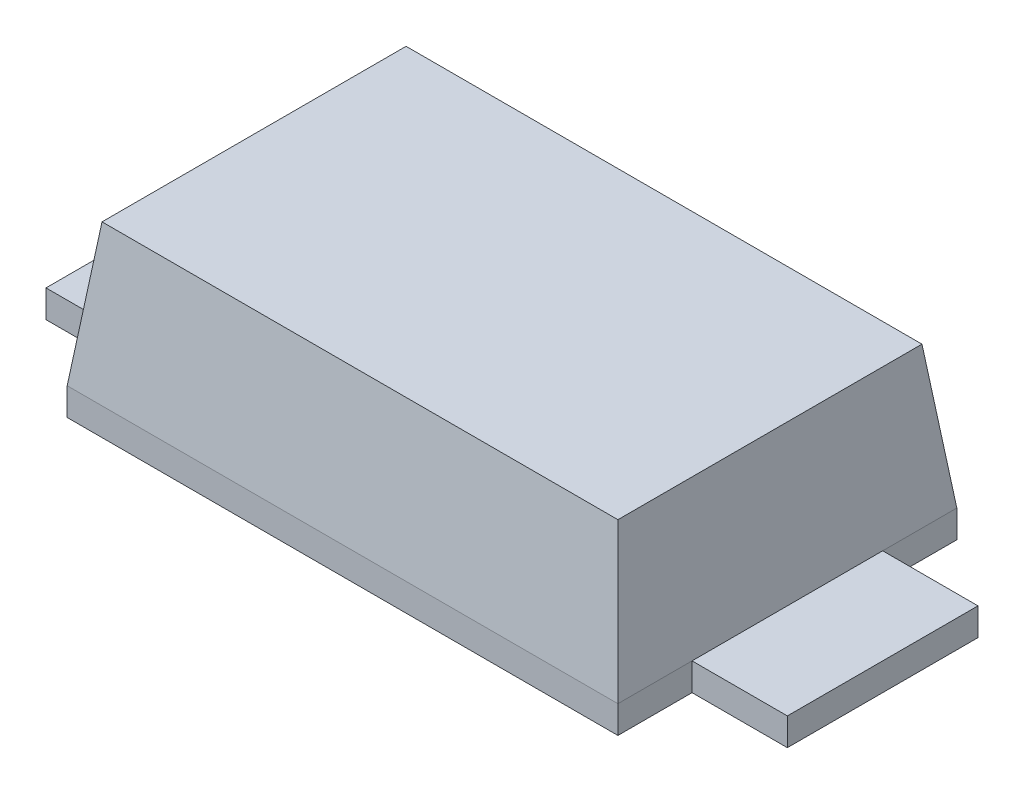
ISO-10303-21;
HEADER;
FILE_DESCRIPTION(('STEP AP214'),'2;1');
FILE_NAME('part.step','',(''),(''),'','','');
FILE_SCHEMA(('AUTOMOTIVE_DESIGN { 1 0 10303 214 1 1 1 1 }'));
ENDSEC;
DATA;
#1=APPLICATION_CONTEXT('core data for automotive mechanical design processes');
#2=APPLICATION_PROTOCOL_DEFINITION('international standard','automotive_design',2000,#1);
#3=PRODUCT_CONTEXT('',#1,'mechanical');
#4=PRODUCT('Part','Part','',(#3));
#5=PRODUCT_RELATED_PRODUCT_CATEGORY('part','',(#4));
#6=PRODUCT_DEFINITION_FORMATION('','',#4);
#7=PRODUCT_DEFINITION_CONTEXT('part definition',#1,'design');
#8=PRODUCT_DEFINITION('design','',#6,#7);
#9=PRODUCT_DEFINITION_SHAPE('','',#8);
#10=(LENGTH_UNIT() NAMED_UNIT(*) SI_UNIT(.MILLI.,.METRE.));
#11=(NAMED_UNIT(*) PLANE_ANGLE_UNIT() SI_UNIT($,.RADIAN.));
#12=(NAMED_UNIT(*) SI_UNIT($,.STERADIAN.) SOLID_ANGLE_UNIT());
#13=UNCERTAINTY_MEASURE_WITH_UNIT(LENGTH_MEASURE(1.E-05),#10,'distance_accuracy_value','');
#14=(GEOMETRIC_REPRESENTATION_CONTEXT(3) GLOBAL_UNCERTAINTY_ASSIGNED_CONTEXT((#13)) GLOBAL_UNIT_ASSIGNED_CONTEXT((#10,
#11,#12)) REPRESENTATION_CONTEXT('',''));
#15=CARTESIAN_POINT('',(0.,0.,0.));
#16=DIRECTION('',(0.,0.,1.));
#17=DIRECTION('',(1.,0.,0.));
#18=AXIS2_PLACEMENT_3D('',#15,#16,#17);
#19=CARTESIAN_POINT('',(-1.3156,0.8,0.717734344));
#20=DIRECTION('',(0.,-0.121869343689811,-0.99254615160637));
#21=DIRECTION('',(1.,0.,0.));
#22=AXIS2_PLACEMENT_3D('',#19,#20,#21);
#23=PLANE('',#22);
#24=DIRECTION('',(1.,0.,0.));
#25=VECTOR('',#24,1.);
#26=CARTESIAN_POINT('',(0.,0.13,0.8));
#27=LINE('',#26,#25);
#28=CARTESIAN_POINT('',(-1.3,0.130000000000001,0.8));
#29=VERTEX_POINT('',#28);
#30=CARTESIAN_POINT('',(1.3,0.13,0.8));
#31=VERTEX_POINT('',#30);
#32=EDGE_CURVE('E164',#29,#31,#27,.T.);
#33=ORIENTED_EDGE('',*,*,#32,.T.);
#34=DIRECTION('',(-0.120974291429793,0.985256535946917,-0.120974291429792));
#35=VECTOR('',#34,1.);
#36=CARTESIAN_POINT('',(1.3,0.13,0.8));
#37=LINE('',#36,#35);
#38=CARTESIAN_POINT('',(1.217734344,0.8,0.717734344));
#39=VERTEX_POINT('',#38);
#40=EDGE_CURVE('E168',#31,#39,#37,.T.);
#41=ORIENTED_EDGE('',*,*,#40,.T.);
#42=DIRECTION('',(-1.,0.,0.));
#43=VECTOR('',#42,1.);
#44=CARTESIAN_POINT('',(0.,0.8,0.717734344));
#45=LINE('',#44,#43);
#46=CARTESIAN_POINT('',(-1.217734344,0.8,0.717734344));
#47=VERTEX_POINT('',#46);
#48=EDGE_CURVE('E167',#39,#47,#45,.T.);
#49=ORIENTED_EDGE('',*,*,#48,.T.);
#50=DIRECTION('',(-0.120974291429793,-0.985256535946917,0.120974291429792));
#51=VECTOR('',#50,1.);
#52=CARTESIAN_POINT('',(-1.217734344,0.8,0.717734344));
#53=LINE('',#52,#51);
#54=EDGE_CURVE('E127',#47,#29,#53,.T.);
#55=ORIENTED_EDGE('',*,*,#54,.T.);
#56=EDGE_LOOP('',(#33,#41,#49,#55));
#57=FACE_BOUND('',#56,.T.);
#58=ADVANCED_FACE('F16',(#57),#23,.F.);
#59=CARTESIAN_POINT('',(-1.217734344,0.8,-0.8));
#60=DIRECTION('',(0.99254615160637,-0.121869343689812,0.));
#61=DIRECTION('',(0.,0.,1.));
#62=AXIS2_PLACEMENT_3D('',#59,#60,#61);
#63=PLANE('',#62);
#64=DIRECTION('',(0.,0.,1.));
#65=VECTOR('',#64,1.);
#66=CARTESIAN_POINT('',(-1.3,0.13,0.625));
#67=LINE('',#66,#65);
#68=CARTESIAN_POINT('',(-1.3,0.13,0.45));
#69=VERTEX_POINT('',#68);
#70=EDGE_CURVE('E172',#69,#29,#67,.T.);
#71=ORIENTED_EDGE('',*,*,#70,.T.);
#72=ORIENTED_EDGE('',*,*,#54,.F.);
#73=DIRECTION('',(0.,0.,-1.));
#74=VECTOR('',#73,1.);
#75=CARTESIAN_POINT('',(-1.217734344,0.8,0.));
#76=LINE('',#75,#74);
#77=CARTESIAN_POINT('',(-1.217734344,0.8,-0.717734344));
#78=VERTEX_POINT('',#77);
#79=EDGE_CURVE('E123',#47,#78,#76,.T.);
#80=ORIENTED_EDGE('',*,*,#79,.T.);
#81=DIRECTION('',(0.120974291429793,0.985256535946917,0.120974291429792));
#82=VECTOR('',#81,1.);
#83=CARTESIAN_POINT('',(-1.3,0.13,-0.8));
#84=LINE('',#83,#82);
#85=CARTESIAN_POINT('',(-1.3,0.13,-0.8));
#86=VERTEX_POINT('',#85);
#87=EDGE_CURVE('E20',#86,#78,#84,.T.);
#88=ORIENTED_EDGE('',*,*,#87,.F.);
#89=DIRECTION('',(0.,0.,-1.));
#90=VECTOR('',#89,1.);
#91=CARTESIAN_POINT('',(-1.3,0.13,0.));
#92=LINE('',#91,#90);
#93=CARTESIAN_POINT('',(-1.3,0.13,-0.45));
#94=VERTEX_POINT('',#93);
#95=EDGE_CURVE('E120',#94,#86,#92,.T.);
#96=ORIENTED_EDGE('',*,*,#95,.F.);
#97=DIRECTION('',(0.,0.,-1.));
#98=VECTOR('',#97,1.);
#99=CARTESIAN_POINT('',(-1.3,0.13,0.));
#100=LINE('',#99,#98);
#101=EDGE_CURVE('E169',#69,#94,#100,.T.);
#102=ORIENTED_EDGE('',*,*,#101,.F.);
#103=EDGE_LOOP('',(#71,#72,#80,#88,#96,#102));
#104=FACE_BOUND('',#103,.T.);
#105=ADVANCED_FACE('F117',(#104),#63,.F.);
#106=CARTESIAN_POINT('',(-1.75,0.13,-0.45));
#107=DIRECTION('',(0.,1.,0.));
#108=DIRECTION('',(0.,0.,1.));
#109=AXIS2_PLACEMENT_3D('',#106,#107,#108);
#110=PLANE('',#109);
#111=DIRECTION('',(0.,0.,-1.));
#112=VECTOR('',#111,1.);
#113=CARTESIAN_POINT('',(-1.75,0.13,0.));
#114=LINE('',#113,#112);
#115=CARTESIAN_POINT('',(-1.75,0.13,0.45));
#116=VERTEX_POINT('',#115);
#117=CARTESIAN_POINT('',(-1.75,0.13,-0.45));
#118=VERTEX_POINT('',#117);
#119=EDGE_CURVE('E159',#116,#118,#114,.T.);
#120=ORIENTED_EDGE('',*,*,#119,.F.);
#121=DIRECTION('',(-1.,0.,0.));
#122=VECTOR('',#121,1.);
#123=CARTESIAN_POINT('',(-1.525,0.13,0.45));
#124=LINE('',#123,#122);
#125=EDGE_CURVE('E206',#69,#116,#124,.T.);
#126=ORIENTED_EDGE('',*,*,#125,.F.);
#127=ORIENTED_EDGE('',*,*,#101,.T.);
#128=DIRECTION('',(1.,0.,0.));
#129=VECTOR('',#128,1.);
#130=CARTESIAN_POINT('',(-1.525,0.13,-0.45));
#131=LINE('',#130,#129);
#132=EDGE_CURVE('E217',#118,#94,#131,.T.);
#133=ORIENTED_EDGE('',*,*,#132,.F.);
#134=EDGE_LOOP('',(#120,#126,#127,#133));
#135=FACE_BOUND('',#134,.T.);
#136=ADVANCED_FACE('F216',(#135),#110,.T.);
#137=CARTESIAN_POINT('',(1.217734344,0.8,0.8));
#138=DIRECTION('',(-0.99254615160637,-0.121869343689812,0.));
#139=DIRECTION('',(0.,0.,-1.));
#140=AXIS2_PLACEMENT_3D('',#137,#138,#139);
#141=PLANE('',#140);
#142=DIRECTION('',(0.,0.,1.));
#143=VECTOR('',#142,1.);
#144=CARTESIAN_POINT('',(1.217734344,0.8,0.));
#145=LINE('',#144,#143);
#146=CARTESIAN_POINT('',(1.217734344,0.8,-0.717734344));
#147=VERTEX_POINT('',#146);
#148=EDGE_CURVE('E163',#147,#39,#145,.T.);
#149=ORIENTED_EDGE('',*,*,#148,.T.);
#150=ORIENTED_EDGE('',*,*,#40,.F.);
#151=DIRECTION('',(0.,0.,-1.));
#152=VECTOR('',#151,1.);
#153=CARTESIAN_POINT('',(1.3,0.13,0.625));
#154=LINE('',#153,#152);
#155=CARTESIAN_POINT('',(1.3,0.13,0.45));
#156=VERTEX_POINT('',#155);
#157=EDGE_CURVE('E155',#31,#156,#154,.T.);
#158=ORIENTED_EDGE('',*,*,#157,.T.);
#159=DIRECTION('',(0.,0.,1.));
#160=VECTOR('',#159,1.);
#161=CARTESIAN_POINT('',(1.3,0.13,0.));
#162=LINE('',#161,#160);
#163=CARTESIAN_POINT('',(1.3,0.13,-0.45));
#164=VERTEX_POINT('',#163);
#165=EDGE_CURVE('E227',#164,#156,#162,.T.);
#166=ORIENTED_EDGE('',*,*,#165,.F.);
#167=DIRECTION('',(0.,0.,1.));
#168=VECTOR('',#167,1.);
#169=CARTESIAN_POINT('',(1.3,0.13,0.));
#170=LINE('',#169,#168);
#171=CARTESIAN_POINT('',(1.3,0.13,-0.8));
#172=VERTEX_POINT('',#171);
#173=EDGE_CURVE('E35',#172,#164,#170,.T.);
#174=ORIENTED_EDGE('',*,*,#173,.F.);
#175=DIRECTION('',(0.120974291429793,-0.985256535946917,-0.120974291429792));
#176=VECTOR('',#175,1.);
#177=CARTESIAN_POINT('',(1.217734344,0.8,-0.717734344));
#178=LINE('',#177,#176);
#179=EDGE_CURVE('E133',#147,#172,#178,.T.);
#180=ORIENTED_EDGE('',*,*,#179,.F.);
#181=EDGE_LOOP('',(#149,#150,#158,#166,#174,#180));
#182=FACE_BOUND('',#181,.T.);
#183=ADVANCED_FACE('F276',(#182),#141,.F.);
#184=CARTESIAN_POINT('',(-1.3,0.,0.8));
#185=DIRECTION('',(1.,0.,0.));
#186=DIRECTION('',(0.,0.,-1.));
#187=AXIS2_PLACEMENT_3D('',#184,#185,#186);
#188=PLANE('',#187);
#189=ORIENTED_EDGE('',*,*,#70,.F.);
#190=DIRECTION('',(0.,1.,0.));
#191=VECTOR('',#190,1.);
#192=CARTESIAN_POINT('',(-1.3,0.065,0.45));
#193=LINE('',#192,#191);
#194=CARTESIAN_POINT('',(-1.299999999625,0.,0.45));
#195=VERTEX_POINT('',#194);
#196=EDGE_CURVE('E183',#195,#69,#193,.T.);
#197=ORIENTED_EDGE('',*,*,#196,.F.);
#198=DIRECTION('',(0.,0.,-1.));
#199=VECTOR('',#198,1.);
#200=CARTESIAN_POINT('',(-1.2999999985,0.,0.));
#201=LINE('',#200,#199);
#202=CARTESIAN_POINT('',(-1.299999999625,0.,0.8));
#203=VERTEX_POINT('',#202);
#204=EDGE_CURVE('E238',#203,#195,#201,.T.);
#205=ORIENTED_EDGE('',*,*,#204,.F.);
#206=DIRECTION('',(0.,1.,0.));
#207=VECTOR('',#206,1.);
#208=CARTESIAN_POINT('',(-1.3,0.065,0.8));
#209=LINE('',#208,#207);
#210=EDGE_CURVE('E190',#203,#29,#209,.T.);
#211=ORIENTED_EDGE('',*,*,#210,.T.);
#212=EDGE_LOOP('',(#189,#197,#205,#211));
#213=FACE_BOUND('',#212,.T.);
#214=ADVANCED_FACE('F274',(#213),#188,.F.);
#215=CARTESIAN_POINT('',(-1.75,0.,0.45));
#216=DIRECTION('',(0.,0.,1.));
#217=DIRECTION('',(1.,0.,0.));
#218=AXIS2_PLACEMENT_3D('',#215,#216,#217);
#219=PLANE('',#218);
#220=DIRECTION('',(0.,1.,0.));
#221=VECTOR('',#220,1.);
#222=CARTESIAN_POINT('',(-1.75,0.065,0.45));
#223=LINE('',#222,#221);
#224=CARTESIAN_POINT('',(-1.75,0.,0.45));
#225=VERTEX_POINT('',#224);
#226=EDGE_CURVE('E204',#225,#116,#223,.T.);
#227=ORIENTED_EDGE('',*,*,#226,.F.);
#228=DIRECTION('',(-1.,0.,0.));
#229=VECTOR('',#228,1.);
#230=CARTESIAN_POINT('',(0.,0.,0.45));
#231=LINE('',#230,#229);
#232=EDGE_CURVE('E213',#195,#225,#231,.T.);
#233=ORIENTED_EDGE('',*,*,#232,.F.);
#234=ORIENTED_EDGE('',*,*,#196,.T.);
#235=ORIENTED_EDGE('',*,*,#125,.T.);
#236=EDGE_LOOP('',(#227,#233,#234,#235));
#237=FACE_BOUND('',#236,.T.);
#238=ADVANCED_FACE('F212',(#237),#219,.T.);
#239=CARTESIAN_POINT('',(-1.75,0.,-0.45));
#240=DIRECTION('',(-1.,0.,0.));
#241=DIRECTION('',(0.,0.,1.));
#242=AXIS2_PLACEMENT_3D('',#239,#240,#241);
#243=PLANE('',#242);
#244=ORIENTED_EDGE('',*,*,#119,.T.);
#245=DIRECTION('',(0.,1.,0.));
#246=VECTOR('',#245,1.);
#247=CARTESIAN_POINT('',(-1.75,0.065,-0.45));
#248=LINE('',#247,#246);
#249=CARTESIAN_POINT('',(-1.75,0.,-0.45));
#250=VERTEX_POINT('',#249);
#251=EDGE_CURVE('E186',#250,#118,#248,.T.);
#252=ORIENTED_EDGE('',*,*,#251,.F.);
#253=DIRECTION('',(0.,0.,-1.));
#254=VECTOR('',#253,1.);
#255=CARTESIAN_POINT('',(-1.75,0.,0.));
#256=LINE('',#255,#254);
#257=EDGE_CURVE('E241',#225,#250,#256,.T.);
#258=ORIENTED_EDGE('',*,*,#257,.F.);
#259=ORIENTED_EDGE('',*,*,#226,.T.);
#260=EDGE_LOOP('',(#244,#252,#258,#259));
#261=FACE_BOUND('',#260,.T.);
#262=ADVANCED_FACE('F221',(#261),#243,.T.);
#263=CARTESIAN_POINT('',(1.3,0.,0.45));
#264=DIRECTION('',(0.,0.,1.));
#265=DIRECTION('',(1.,0.,0.));
#266=AXIS2_PLACEMENT_3D('',#263,#264,#265);
#267=PLANE('',#266);
#268=DIRECTION('',(0.,-1.,0.));
#269=VECTOR('',#268,1.);
#270=CARTESIAN_POINT('',(1.75,0.065,0.45));
#271=LINE('',#270,#269);
#272=CARTESIAN_POINT('',(1.75,0.13,0.45));
#273=VERTEX_POINT('',#272);
#274=CARTESIAN_POINT('',(1.75,0.,0.45));
#275=VERTEX_POINT('',#274);
#276=EDGE_CURVE('E236',#273,#275,#271,.T.);
#277=ORIENTED_EDGE('',*,*,#276,.F.);
#278=DIRECTION('',(1.,0.,0.));
#279=VECTOR('',#278,1.);
#280=CARTESIAN_POINT('',(1.525,0.13,0.45));
#281=LINE('',#280,#279);
#282=EDGE_CURVE('E229',#156,#273,#281,.T.);
#283=ORIENTED_EDGE('',*,*,#282,.F.);
#284=DIRECTION('',(0.,-1.,0.));
#285=VECTOR('',#284,1.);
#286=CARTESIAN_POINT('',(1.3,0.065,0.45));
#287=LINE('',#286,#285);
#288=CARTESIAN_POINT('',(1.299999999625,0.,0.45));
#289=VERTEX_POINT('',#288);
#290=EDGE_CURVE('E158',#156,#289,#287,.T.);
#291=ORIENTED_EDGE('',*,*,#290,.T.);
#292=DIRECTION('',(-1.,0.,0.));
#293=VECTOR('',#292,1.);
#294=CARTESIAN_POINT('',(0.,0.,0.45));
#295=LINE('',#294,#293);
#296=EDGE_CURVE('E249',#275,#289,#295,.T.);
#297=ORIENTED_EDGE('',*,*,#296,.F.);
#298=EDGE_LOOP('',(#277,#283,#291,#297));
#299=FACE_BOUND('',#298,.T.);
#300=ADVANCED_FACE('F322',(#299),#267,.T.);
#301=CARTESIAN_POINT('',(1.3,0.,0.45));
#302=DIRECTION('',(-1.,0.,0.));
#303=DIRECTION('',(0.,0.,1.));
#304=AXIS2_PLACEMENT_3D('',#301,#302,#303);
#305=PLANE('',#304);
#306=ORIENTED_EDGE('',*,*,#157,.F.);
#307=DIRECTION('',(0.,-1.,0.));
#308=VECTOR('',#307,1.);
#309=CARTESIAN_POINT('',(1.3,0.065,0.8));
#310=LINE('',#309,#308);
#311=CARTESIAN_POINT('',(1.299999999625,0.,0.8));
#312=VERTEX_POINT('',#311);
#313=EDGE_CURVE('E160',#31,#312,#310,.T.);
#314=ORIENTED_EDGE('',*,*,#313,.T.);
#315=DIRECTION('',(0.,0.,1.));
#316=VECTOR('',#315,1.);
#317=CARTESIAN_POINT('',(1.2999999985,0.,0.));
#318=LINE('',#317,#316);
#319=EDGE_CURVE('E251',#289,#312,#318,.T.);
#320=ORIENTED_EDGE('',*,*,#319,.F.);
#321=ORIENTED_EDGE('',*,*,#290,.F.);
#322=EDGE_LOOP('',(#306,#314,#320,#321));
#323=FACE_BOUND('',#322,.T.);
#324=ADVANCED_FACE('F318',(#323),#305,.F.);
#325=CARTESIAN_POINT('',(1.3,0.,0.8));
#326=DIRECTION('',(0.,0.,-1.));
#327=DIRECTION('',(-1.,0.,0.));
#328=AXIS2_PLACEMENT_3D('',#325,#326,#327);
#329=PLANE('',#328);
#330=ORIENTED_EDGE('',*,*,#32,.F.);
#331=ORIENTED_EDGE('',*,*,#210,.F.);
#332=DIRECTION('',(-1.,0.,0.));
#333=VECTOR('',#332,1.);
#334=CARTESIAN_POINT('',(0.,0.,0.8));
#335=LINE('',#334,#333);
#336=EDGE_CURVE('E154',#312,#203,#335,.T.);
#337=ORIENTED_EDGE('',*,*,#336,.F.);
#338=ORIENTED_EDGE('',*,*,#313,.F.);
#339=EDGE_LOOP('',(#330,#331,#337,#338));
#340=FACE_BOUND('',#339,.T.);
#341=ADVANCED_FACE('F314',(#340),#329,.F.);
#342=CARTESIAN_POINT('',(-1.217734344,0.8,0.717734344));
#343=DIRECTION('',(0.,-1.,0.));
#344=DIRECTION('',(0.,0.,-1.));
#345=AXIS2_PLACEMENT_3D('',#342,#343,#344);
#346=PLANE('',#345);
#347=ORIENTED_EDGE('',*,*,#48,.F.);
#348=ORIENTED_EDGE('',*,*,#148,.F.);
#349=DIRECTION('',(-1.,0.,0.));
#350=VECTOR('',#349,1.);
#351=CARTESIAN_POINT('',(0.,0.8,-0.717734344));
#352=LINE('',#351,#350);
#353=EDGE_CURVE('E151',#147,#78,#352,.T.);
#354=ORIENTED_EDGE('',*,*,#353,.T.);
#355=ORIENTED_EDGE('',*,*,#79,.F.);
#356=EDGE_LOOP('',(#347,#348,#354,#355));
#357=FACE_BOUND('',#356,.T.);
#358=ADVANCED_FACE('F311',(#357),#346,.F.);
#359=CARTESIAN_POINT('',(-1.3,0.,-0.45));
#360=DIRECTION('',(0.,0.,-1.));
#361=DIRECTION('',(-1.,0.,0.));
#362=AXIS2_PLACEMENT_3D('',#359,#360,#361);
#363=PLANE('',#362);
#364=ORIENTED_EDGE('',*,*,#251,.T.);
#365=ORIENTED_EDGE('',*,*,#132,.T.);
#366=DIRECTION('',(0.,-1.,0.));
#367=VECTOR('',#366,1.);
#368=CARTESIAN_POINT('',(-1.3,0.065,-0.45));
#369=LINE('',#368,#367);
#370=CARTESIAN_POINT('',(-1.29999999925,0.,-0.45));
#371=VERTEX_POINT('',#370);
#372=EDGE_CURVE('E148',#94,#371,#369,.T.);
#373=ORIENTED_EDGE('',*,*,#372,.T.);
#374=DIRECTION('',(1.,0.,0.));
#375=VECTOR('',#374,1.);
#376=CARTESIAN_POINT('',(0.,0.,-0.45));
#377=LINE('',#376,#375);
#378=EDGE_CURVE('E226',#250,#371,#377,.T.);
#379=ORIENTED_EDGE('',*,*,#378,.F.);
#380=EDGE_LOOP('',(#364,#365,#373,#379));
#381=FACE_BOUND('',#380,.T.);
#382=ADVANCED_FACE('F225',(#381),#363,.T.);
#383=CARTESIAN_POINT('',(1.3,0.13,-0.45));
#384=DIRECTION('',(0.,1.,0.));
#385=DIRECTION('',(0.,0.,1.));
#386=AXIS2_PLACEMENT_3D('',#383,#384,#385);
#387=PLANE('',#386);
#388=DIRECTION('',(0.,0.,1.));
#389=VECTOR('',#388,1.);
#390=CARTESIAN_POINT('',(1.75,0.13,0.));
#391=LINE('',#390,#389);
#392=CARTESIAN_POINT('',(1.75,0.13,-0.45));
#393=VERTEX_POINT('',#392);
#394=EDGE_CURVE('E233',#393,#273,#391,.T.);
#395=ORIENTED_EDGE('',*,*,#394,.F.);
#396=DIRECTION('',(1.,0.,0.));
#397=VECTOR('',#396,1.);
#398=CARTESIAN_POINT('',(1.525,0.13,-0.45));
#399=LINE('',#398,#397);
#400=EDGE_CURVE('E257',#164,#393,#399,.T.);
#401=ORIENTED_EDGE('',*,*,#400,.F.);
#402=ORIENTED_EDGE('',*,*,#165,.T.);
#403=ORIENTED_EDGE('',*,*,#282,.T.);
#404=EDGE_LOOP('',(#395,#401,#402,#403));
#405=FACE_BOUND('',#404,.T.);
#406=ADVANCED_FACE('F304',(#405),#387,.T.);
#407=CARTESIAN_POINT('',(1.75,0.,0.45));
#408=DIRECTION('',(1.,0.,0.));
#409=DIRECTION('',(0.,0.,-1.));
#410=AXIS2_PLACEMENT_3D('',#407,#408,#409);
#411=PLANE('',#410);
#412=ORIENTED_EDGE('',*,*,#394,.T.);
#413=ORIENTED_EDGE('',*,*,#276,.T.);
#414=DIRECTION('',(0.,0.,1.));
#415=VECTOR('',#414,1.);
#416=CARTESIAN_POINT('',(1.75,0.,0.));
#417=LINE('',#416,#415);
#418=CARTESIAN_POINT('',(1.75,0.,-0.45));
#419=VERTEX_POINT('',#418);
#420=EDGE_CURVE('E246',#419,#275,#417,.T.);
#421=ORIENTED_EDGE('',*,*,#420,.F.);
#422=DIRECTION('',(0.,-1.,0.));
#423=VECTOR('',#422,1.);
#424=CARTESIAN_POINT('',(1.75,0.065,-0.45));
#425=LINE('',#424,#423);
#426=EDGE_CURVE('E259',#393,#419,#425,.T.);
#427=ORIENTED_EDGE('',*,*,#426,.F.);
#428=EDGE_LOOP('',(#412,#413,#421,#427));
#429=FACE_BOUND('',#428,.T.);
#430=ADVANCED_FACE('F301',(#429),#411,.T.);
#431=CARTESIAN_POINT('',(-1.75,0.,0.8));
#432=DIRECTION('',(0.,-1.,0.));
#433=DIRECTION('',(0.,0.,-1.));
#434=AXIS2_PLACEMENT_3D('',#431,#432,#433);
#435=PLANE('',#434);
#436=ORIENTED_EDGE('',*,*,#319,.T.);
#437=ORIENTED_EDGE('',*,*,#336,.T.);
#438=ORIENTED_EDGE('',*,*,#204,.T.);
#439=ORIENTED_EDGE('',*,*,#232,.T.);
#440=ORIENTED_EDGE('',*,*,#257,.T.);
#441=ORIENTED_EDGE('',*,*,#378,.T.);
#442=DIRECTION('',(0.,0.,-1.));
#443=VECTOR('',#442,1.);
#444=CARTESIAN_POINT('',(-1.3,0.,-0.625));
#445=LINE('',#444,#443);
#446=CARTESIAN_POINT('',(-1.29999999925,0.,-0.8));
#447=VERTEX_POINT('',#446);
#448=EDGE_CURVE('E153',#371,#447,#445,.T.);
#449=ORIENTED_EDGE('',*,*,#448,.T.);
#450=DIRECTION('',(1.,0.,0.));
#451=VECTOR('',#450,1.);
#452=CARTESIAN_POINT('',(0.,0.,-0.8));
#453=LINE('',#452,#451);
#454=CARTESIAN_POINT('',(1.29999999925,0.,-0.8));
#455=VERTEX_POINT('',#454);
#456=EDGE_CURVE('E136',#447,#455,#453,.T.);
#457=ORIENTED_EDGE('',*,*,#456,.T.);
#458=DIRECTION('',(0.,0.,1.));
#459=VECTOR('',#458,1.);
#460=CARTESIAN_POINT('',(1.2999999985,0.,0.));
#461=LINE('',#460,#459);
#462=CARTESIAN_POINT('',(1.29999999925,0.,-0.45));
#463=VERTEX_POINT('',#462);
#464=EDGE_CURVE('E244',#455,#463,#461,.T.);
#465=ORIENTED_EDGE('',*,*,#464,.T.);
#466=DIRECTION('',(-1.,0.,0.));
#467=VECTOR('',#466,1.);
#468=CARTESIAN_POINT('',(1.525,0.,-0.45));
#469=LINE('',#468,#467);
#470=EDGE_CURVE('E261',#419,#463,#469,.T.);
#471=ORIENTED_EDGE('',*,*,#470,.F.);
#472=ORIENTED_EDGE('',*,*,#420,.T.);
#473=ORIENTED_EDGE('',*,*,#296,.T.);
#474=EDGE_LOOP('',(#436,#437,#438,#439,#440,#441,#449,#457,#465,#471,#472,#473));
#475=FACE_BOUND('',#474,.T.);
#476=ADVANCED_FACE('F272',(#475),#435,.T.);
#477=CARTESIAN_POINT('',(1.3156,0.8,-0.717734344));
#478=DIRECTION('',(0.,-0.121869343689811,0.99254615160637));
#479=DIRECTION('',(-1.,0.,0.));
#480=AXIS2_PLACEMENT_3D('',#477,#478,#479);
#481=PLANE('',#480);
#482=DIRECTION('',(-1.,0.,0.));
#483=VECTOR('',#482,1.);
#484=CARTESIAN_POINT('',(0.,0.13,-0.8));
#485=LINE('',#484,#483);
#486=EDGE_CURVE('E130',#172,#86,#485,.T.);
#487=ORIENTED_EDGE('',*,*,#486,.T.);
#488=ORIENTED_EDGE('',*,*,#87,.T.);
#489=ORIENTED_EDGE('',*,*,#353,.F.);
#490=ORIENTED_EDGE('',*,*,#179,.T.);
#491=EDGE_LOOP('',(#487,#488,#489,#490));
#492=FACE_BOUND('',#491,.T.);
#493=ADVANCED_FACE('F132',(#492),#481,.F.);
#494=CARTESIAN_POINT('',(-1.3,0.,-0.45));
#495=DIRECTION('',(1.,0.,0.));
#496=DIRECTION('',(0.,0.,-1.));
#497=AXIS2_PLACEMENT_3D('',#494,#495,#496);
#498=PLANE('',#497);
#499=ORIENTED_EDGE('',*,*,#95,.T.);
#500=DIRECTION('',(0.,-1.,0.));
#501=VECTOR('',#500,1.);
#502=CARTESIAN_POINT('',(-1.3,0.065,-0.8));
#503=LINE('',#502,#501);
#504=EDGE_CURVE('E135',#86,#447,#503,.T.);
#505=ORIENTED_EDGE('',*,*,#504,.T.);
#506=ORIENTED_EDGE('',*,*,#448,.F.);
#507=ORIENTED_EDGE('',*,*,#372,.F.);
#508=EDGE_LOOP('',(#499,#505,#506,#507));
#509=FACE_BOUND('',#508,.T.);
#510=ADVANCED_FACE('F146',(#509),#498,.F.);
#511=CARTESIAN_POINT('',(1.75,0.,-0.45));
#512=DIRECTION('',(0.,0.,-1.));
#513=DIRECTION('',(-1.,0.,0.));
#514=AXIS2_PLACEMENT_3D('',#511,#512,#513);
#515=PLANE('',#514);
#516=ORIENTED_EDGE('',*,*,#426,.T.);
#517=ORIENTED_EDGE('',*,*,#470,.T.);
#518=DIRECTION('',(0.,1.,0.));
#519=VECTOR('',#518,1.);
#520=CARTESIAN_POINT('',(1.3,0.065,-0.45));
#521=LINE('',#520,#519);
#522=EDGE_CURVE('E26',#463,#164,#521,.T.);
#523=ORIENTED_EDGE('',*,*,#522,.T.);
#524=ORIENTED_EDGE('',*,*,#400,.T.);
#525=EDGE_LOOP('',(#516,#517,#523,#524));
#526=FACE_BOUND('',#525,.T.);
#527=ADVANCED_FACE('F267',(#526),#515,.T.);
#528=CARTESIAN_POINT('',(-1.3,0.,-0.8));
#529=DIRECTION('',(0.,0.,1.));
#530=DIRECTION('',(1.,0.,0.));
#531=AXIS2_PLACEMENT_3D('',#528,#529,#530);
#532=PLANE('',#531);
#533=ORIENTED_EDGE('',*,*,#486,.F.);
#534=DIRECTION('',(0.,-1.,0.));
#535=VECTOR('',#534,1.);
#536=CARTESIAN_POINT('',(1.3,0.065,-0.8));
#537=LINE('',#536,#535);
#538=EDGE_CURVE('E11',#172,#455,#537,.T.);
#539=ORIENTED_EDGE('',*,*,#538,.T.);
#540=ORIENTED_EDGE('',*,*,#456,.F.);
#541=ORIENTED_EDGE('',*,*,#504,.F.);
#542=EDGE_LOOP('',(#533,#539,#540,#541));
#543=FACE_BOUND('',#542,.T.);
#544=ADVANCED_FACE('F139',(#543),#532,.F.);
#545=CARTESIAN_POINT('',(1.3,0.,-0.8));
#546=DIRECTION('',(-1.,0.,0.));
#547=DIRECTION('',(0.,0.,1.));
#548=AXIS2_PLACEMENT_3D('',#545,#546,#547);
#549=PLANE('',#548);
#550=ORIENTED_EDGE('',*,*,#173,.T.);
#551=ORIENTED_EDGE('',*,*,#522,.F.);
#552=ORIENTED_EDGE('',*,*,#464,.F.);
#553=ORIENTED_EDGE('',*,*,#538,.F.);
#554=EDGE_LOOP('',(#550,#551,#552,#553));
#555=FACE_BOUND('',#554,.T.);
#556=ADVANCED_FACE('F18',(#555),#549,.F.);
#557=CLOSED_SHELL('',(#58,#105,#136,#183,#214,#238,#262,#300,#324,#341,#358,#382,#406,#430,#476,
#493,#510,#527,#544,#556));
#558=MANIFOLD_SOLID_BREP('B1',#557);
#559=ADVANCED_BREP_SHAPE_REPRESENTATION('',(#18,#558),#14);
#560=SHAPE_DEFINITION_REPRESENTATION(#9,#559);
ENDSEC;
END-ISO-10303-21;
